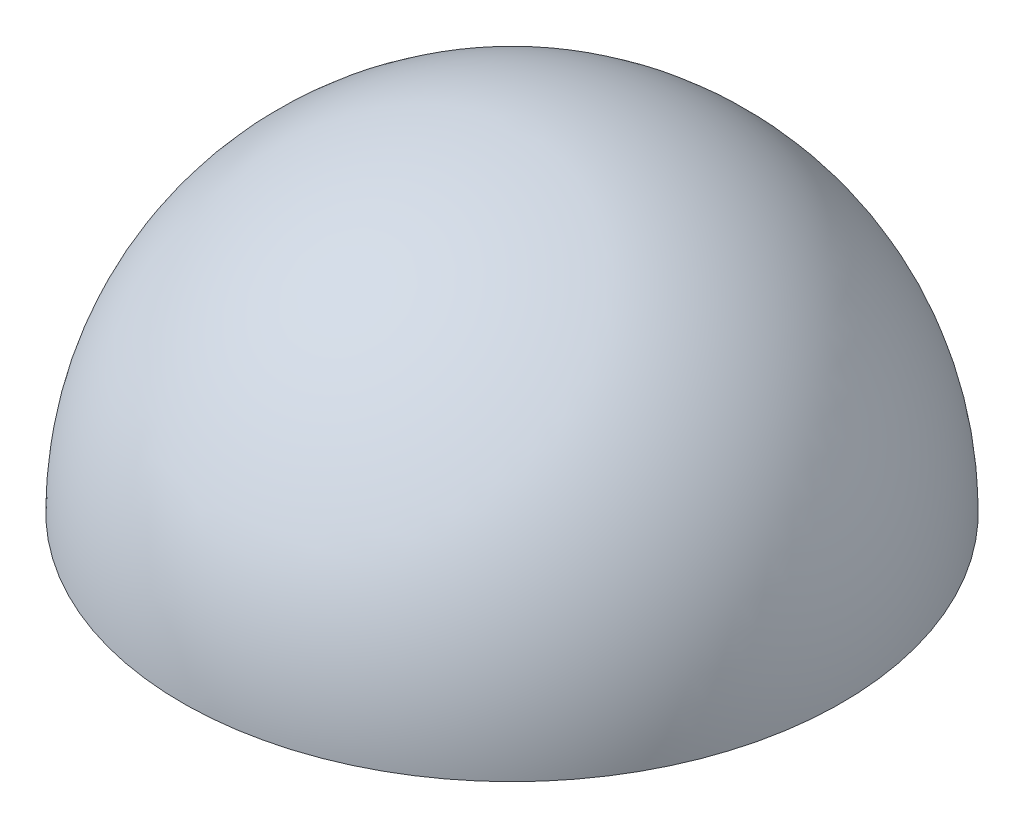
ISO-10303-21;
HEADER;
FILE_DESCRIPTION(('STEP AP214'),'2;1');
FILE_NAME('part.step','',(''),(''),'','','');
FILE_SCHEMA(('AUTOMOTIVE_DESIGN { 1 0 10303 214 1 1 1 1 }'));
ENDSEC;
DATA;
#1=APPLICATION_CONTEXT('core data for automotive mechanical design processes');
#2=APPLICATION_PROTOCOL_DEFINITION('international standard','automotive_design',2000,#1);
#3=PRODUCT_CONTEXT('',#1,'mechanical');
#4=PRODUCT('Part','Part','',(#3));
#5=PRODUCT_RELATED_PRODUCT_CATEGORY('part','',(#4));
#6=PRODUCT_DEFINITION_FORMATION('','',#4);
#7=PRODUCT_DEFINITION_CONTEXT('part definition',#1,'design');
#8=PRODUCT_DEFINITION('design','',#6,#7);
#9=PRODUCT_DEFINITION_SHAPE('','',#8);
#10=(LENGTH_UNIT() NAMED_UNIT(*) SI_UNIT(.MILLI.,.METRE.));
#11=(NAMED_UNIT(*) PLANE_ANGLE_UNIT() SI_UNIT($,.RADIAN.));
#12=(NAMED_UNIT(*) SI_UNIT($,.STERADIAN.) SOLID_ANGLE_UNIT());
#13=UNCERTAINTY_MEASURE_WITH_UNIT(LENGTH_MEASURE(1.E-05),#10,'distance_accuracy_value','');
#14=(GEOMETRIC_REPRESENTATION_CONTEXT(3) GLOBAL_UNCERTAINTY_ASSIGNED_CONTEXT((#13)) GLOBAL_UNIT_ASSIGNED_CONTEXT((#10,
#11,#12)) REPRESENTATION_CONTEXT('',''));
#15=CARTESIAN_POINT('',(0.,0.,0.));
#16=DIRECTION('',(0.,0.,1.));
#17=DIRECTION('',(1.,0.,0.));
#18=AXIS2_PLACEMENT_3D('',#15,#16,#17);
#19=CARTESIAN_POINT('',(0.,-8.,0.));
#20=DIRECTION('',(0.,-1.,0.));
#21=DIRECTION('',(1.,0.,0.));
#22=AXIS2_PLACEMENT_3D('',#19,#20,#21);
#23=CYLINDRICAL_SURFACE('',#22,39.);
#24=CARTESIAN_POINT('',(0.,-8.,0.));
#25=DIRECTION('',(0.,-1.,0.));
#26=DIRECTION('',(1.,0.,0.));
#27=AXIS2_PLACEMENT_3D('',#24,#25,#26);
#28=CIRCLE('',#27,39.);
#29=CARTESIAN_POINT('',(-10.0939427589983,-7.99999999999973,37.6711072252737));
#30=VERTEX_POINT('',#29);
#31=CARTESIAN_POINT('',(-27.5771644662754,-8.00000000000018,27.5771644662752));
#32=VERTEX_POINT('',#31);
#33=EDGE_CURVE('E162',#30,#32,#28,.T.);
#34=ORIENTED_EDGE('',*,*,#33,.T.);
#35=DIRECTION('',(0.,-1.,0.));
#36=VECTOR('',#35,1.);
#37=CARTESIAN_POINT('',(-27.5771644662755,-2.00000000000019,27.5771644662752));
#38=LINE('',#37,#36);
#39=CARTESIAN_POINT('',(-27.5771644662754,-12.0000000000002,27.5771644662752));
#40=VERTEX_POINT('',#39);
#41=EDGE_CURVE('E322',#32,#40,#38,.T.);
#42=ORIENTED_EDGE('',*,*,#41,.T.);
#43=CARTESIAN_POINT('',(0.,-12.,0.));
#44=DIRECTION('',(0.,-1.,0.));
#45=DIRECTION('',(1.,0.,0.));
#46=AXIS2_PLACEMENT_3D('',#43,#44,#45);
#47=CIRCLE('',#46,39.);
#48=CARTESIAN_POINT('',(-10.0939427589982,-12.0000000000001,37.6711072252737));
#49=VERTEX_POINT('',#48);
#50=EDGE_CURVE('E149',#49,#40,#47,.T.);
#51=ORIENTED_EDGE('',*,*,#50,.F.);
#52=DIRECTION('',(0.,-1.,0.));
#53=VECTOR('',#52,1.);
#54=CARTESIAN_POINT('',(-10.0939427589983,-2.00000000000006,37.6711072252737));
#55=LINE('',#54,#53);
#56=EDGE_CURVE('E241',#30,#49,#55,.T.);
#57=ORIENTED_EDGE('',*,*,#56,.F.);
#58=EDGE_LOOP('',(#34,#42,#51,#57));
#59=FACE_BOUND('',#58,.T.);
#60=ADVANCED_FACE('F33',(#59),#23,.T.);
#61=DIRECTION('',(0.,-1.,0.));
#62=VECTOR('',#61,1.);
#63=CARTESIAN_POINT('',(37.6711072252738,-1.99999999999974,-10.093942758998));
#64=LINE('',#63,#62);
#65=CARTESIAN_POINT('',(37.6711072252738,-7.99999999999973,-10.093942758998));
#66=VERTEX_POINT('',#65);
#67=CARTESIAN_POINT('',(37.6711072252738,-11.9999999999997,-10.093942758998));
#68=VERTEX_POINT('',#67);
#69=EDGE_CURVE('E142',#66,#68,#64,.T.);
#70=ORIENTED_EDGE('',*,*,#69,.F.);
#71=CARTESIAN_POINT('',(37.6711072252738,-7.99999999999975,10.0939427589981));
#72=VERTEX_POINT('',#71);
#73=EDGE_CURVE('E153',#66,#72,#28,.T.);
#74=ORIENTED_EDGE('',*,*,#73,.T.);
#75=DIRECTION('',(0.,-1.,0.));
#76=VECTOR('',#75,1.);
#77=CARTESIAN_POINT('',(37.6711072252737,-1.99999999999973,10.0939427589981));
#78=LINE('',#77,#76);
#79=CARTESIAN_POINT('',(37.6711072252738,-11.9999999999997,10.0939427589981));
#80=VERTEX_POINT('',#79);
#81=EDGE_CURVE('E226',#72,#80,#78,.T.);
#82=ORIENTED_EDGE('',*,*,#81,.T.);
#83=EDGE_CURVE('E150',#68,#80,#47,.T.);
#84=ORIENTED_EDGE('',*,*,#83,.F.);
#85=EDGE_LOOP('',(#70,#74,#82,#84));
#86=FACE_BOUND('',#85,.T.);
#87=ADVANCED_FACE('F181',(#86),#23,.T.);
#88=CARTESIAN_POINT('',(0.,7.,0.));
#89=DIRECTION('',(0.,-1.,0.));
#90=DIRECTION('',(1.,0.,0.));
#91=AXIS2_PLACEMENT_3D('',#88,#89,#90);
#92=PLANE('',#91);
#93=CARTESIAN_POINT('',(0.,7.,0.));
#94=DIRECTION('',(0.,-1.,0.));
#95=DIRECTION('',(1.,0.,0.));
#96=AXIS2_PLACEMENT_3D('',#93,#94,#95);
#97=CIRCLE('',#96,30.);
#98=CARTESIAN_POINT('',(30.,7.00000000000021,0.));
#99=VERTEX_POINT('',#98);
#100=EDGE_CURVE('E37',#99,#99,#97,.T.);
#101=ORIENTED_EDGE('',*,*,#100,.T.);
#102=EDGE_LOOP('',(#101));
#103=FACE_BOUND('',#102,.T.);
#104=CARTESIAN_POINT('',(0.,7.,0.));
#105=DIRECTION('',(0.,-1.,0.));
#106=DIRECTION('',(1.,0.,0.));
#107=AXIS2_PLACEMENT_3D('',#104,#105,#106);
#108=CIRCLE('',#107,49.5075751779463);
#109=CARTESIAN_POINT('',(49.5075751779462,7.00000000000035,0.));
#110=VERTEX_POINT('',#109);
#111=EDGE_CURVE('E42',#110,#110,#108,.F.);
#112=ORIENTED_EDGE('',*,*,#111,.T.);
#113=EDGE_LOOP('',(#112));
#114=FACE_BOUND('',#113,.T.);
#115=ADVANCED_FACE('F168',(#103,#114),#92,.F.);
#116=CARTESIAN_POINT('',(0.,0.,0.));
#117=DIRECTION('',(0.999613841431887,0.,0.0277879113606428));
#118=DIRECTION('',(0.0277879113606428,0.,-0.999613841431887));
#119=AXIS2_PLACEMENT_3D('',#116,#117,#118);
#120=SPHERICAL_SURFACE('',#119,50.);
#121=CARTESIAN_POINT('',(0.,0.,0.));
#122=DIRECTION('',(0.,-1.,0.));
#123=DIRECTION('',(1.,0.,0.));
#124=AXIS2_PLACEMENT_3D('',#121,#122,#123);
#125=SPHERICAL_SURFACE('',#124,50.);
#126=ORIENTED_EDGE('',*,*,#111,.F.);
#127=EDGE_LOOP('',(#126));
#128=FACE_BOUND('',#127,.T.);
#129=ADVANCED_FACE('F170',(#128),#125,.F.);
#130=CARTESIAN_POINT('',(0.,12.,0.));
#131=DIRECTION('',(0.,-1.,0.));
#132=DIRECTION('',(1.,0.,0.));
#133=AXIS2_PLACEMENT_3D('',#130,#131,#132);
#134=CYLINDRICAL_SURFACE('',#133,30.);
#135=CARTESIAN_POINT('',(0.,-12.,0.));
#136=DIRECTION('',(0.,-1.,0.));
#137=DIRECTION('',(1.,0.,0.));
#138=AXIS2_PLACEMENT_3D('',#135,#136,#137);
#139=CIRCLE('',#138,30.);
#140=CARTESIAN_POINT('',(30.0000000000001,-11.9999999999998,0.));
#141=VERTEX_POINT('',#140);
#142=EDGE_CURVE('E256',#141,#141,#139,.T.);
#143=ORIENTED_EDGE('',*,*,#142,.T.);
#144=EDGE_LOOP('',(#143));
#145=FACE_BOUND('',#144,.T.);
#146=ORIENTED_EDGE('',*,*,#100,.F.);
#147=EDGE_LOOP('',(#146));
#148=FACE_BOUND('',#147,.T.);
#149=ADVANCED_FACE('F172',(#145,#148),#134,.F.);
#150=CARTESIAN_POINT('',(0.,-12.,0.));
#151=DIRECTION('',(0.,1.,0.));
#152=DIRECTION('',(-1.,0.,0.));
#153=AXIS2_PLACEMENT_3D('',#150,#151,#152);
#154=CYLINDRICAL_SURFACE('',#153,34.5);
#155=CARTESIAN_POINT('',(0.,0.,0.));
#156=DIRECTION('',(0.,-1.,0.));
#157=DIRECTION('',(1.,0.,0.));
#158=AXIS2_PLACEMENT_3D('',#155,#156,#157);
#159=CIRCLE('',#158,34.5);
#160=CARTESIAN_POINT('',(34.5,2.40823587287632E-13,0.));
#161=VERTEX_POINT('',#160);
#162=EDGE_CURVE('E158',#161,#161,#159,.T.);
#163=ORIENTED_EDGE('',*,*,#162,.T.);
#164=EDGE_LOOP('',(#163));
#165=FACE_BOUND('',#164,.T.);
#166=CARTESIAN_POINT('',(0.,-8.,0.));
#167=DIRECTION('',(0.,-1.,0.));
#168=DIRECTION('',(1.,0.,0.));
#169=AXIS2_PLACEMENT_3D('',#166,#167,#168);
#170=CIRCLE('',#169,34.5);
#171=CARTESIAN_POINT('',(34.5,-7.99999999999976,0.));
#172=VERTEX_POINT('',#171);
#173=EDGE_CURVE('E11',#172,#172,#170,.T.);
#174=ORIENTED_EDGE('',*,*,#173,.F.);
#175=EDGE_LOOP('',(#174));
#176=FACE_BOUND('',#175,.T.);
#177=ADVANCED_FACE('F178',(#165,#176),#154,.T.);
#178=CARTESIAN_POINT('',(0.,0.,0.));
#179=DIRECTION('',(0.0271221426448348,0.,-0.999632127023913));
#180=DIRECTION('',(-0.999632127023913,0.,-0.0271221426448348));
#181=AXIS2_PLACEMENT_3D('',#178,#179,#180);
#182=SPHERICAL_SURFACE('',#181,55.);
#183=CARTESIAN_POINT('',(0.,0.,0.));
#184=DIRECTION('',(0.,-1.,0.));
#185=DIRECTION('',(-0.0542243302830044,0.,0.998528778756707));
#186=AXIS2_PLACEMENT_3D('',#183,#184,#185);
#187=SPHERICAL_SURFACE('',#186,55.);
#188=CARTESIAN_POINT('',(0.,0.,0.));
#189=DIRECTION('',(0.,-1.,0.));
#190=DIRECTION('',(-0.0542243302830044,0.,0.998528778756707));
#191=AXIS2_PLACEMENT_3D('',#188,#189,#190);
#192=CIRCLE('',#191,55.);
#193=CARTESIAN_POINT('',(-2.98233816556524,0.,54.9190828316189));
#194=VERTEX_POINT('',#193);
#195=EDGE_CURVE('E161',#194,#194,#192,.T.);
#196=ORIENTED_EDGE('',*,*,#195,.F.);
#197=EDGE_LOOP('',(#196));
#198=FACE_BOUND('',#197,.T.);
#199=ADVANCED_FACE('F35',(#198),#187,.T.);
#200=CARTESIAN_POINT('',(0.,0.,0.));
#201=DIRECTION('',(0.,-1.,0.));
#202=DIRECTION('',(-0.0542243302830044,0.,0.998528778756707));
#203=AXIS2_PLACEMENT_3D('',#200,#201,#202);
#204=PLANE('',#203);
#205=ORIENTED_EDGE('',*,*,#162,.F.);
#206=EDGE_LOOP('',(#205));
#207=FACE_BOUND('',#206,.T.);
#208=ORIENTED_EDGE('',*,*,#195,.T.);
#209=EDGE_LOOP('',(#208));
#210=FACE_BOUND('',#209,.T.);
#211=ADVANCED_FACE('F196',(#207,#210),#204,.T.);
#212=DIRECTION('',(0.,-1.,0.));
#213=VECTOR('',#212,1.);
#214=CARTESIAN_POINT('',(-27.5771644662754,-2.0000000000002,-27.5771644662753));
#215=LINE('',#214,#213);
#216=CARTESIAN_POINT('',(-27.5771644662753,-7.99999999999973,-27.5771644662753));
#217=VERTEX_POINT('',#216);
#218=CARTESIAN_POINT('',(-27.5771644662753,-12.0000000000002,-27.5771644662753));
#219=VERTEX_POINT('',#218);
#220=EDGE_CURVE('E320',#217,#219,#215,.T.);
#221=ORIENTED_EDGE('',*,*,#220,.F.);
#222=CARTESIAN_POINT('',(-10.0939427589985,-8.00000000000007,-37.6711072252736));
#223=VERTEX_POINT('',#222);
#224=EDGE_CURVE('E141',#217,#223,#28,.T.);
#225=ORIENTED_EDGE('',*,*,#224,.T.);
#226=DIRECTION('',(0.,-1.,0.));
#227=VECTOR('',#226,1.);
#228=CARTESIAN_POINT('',(-10.0939427589985,-2.00000000000008,-37.6711072252736));
#229=LINE('',#228,#227);
#230=CARTESIAN_POINT('',(-10.0939427589985,-12.0000000000001,-37.6711072252736));
#231=VERTEX_POINT('',#230);
#232=EDGE_CURVE('E127',#223,#231,#229,.T.);
#233=ORIENTED_EDGE('',*,*,#232,.T.);
#234=EDGE_CURVE('E139',#219,#231,#47,.T.);
#235=ORIENTED_EDGE('',*,*,#234,.F.);
#236=EDGE_LOOP('',(#221,#225,#233,#235));
#237=FACE_BOUND('',#236,.T.);
#238=ADVANCED_FACE('F138',(#237),#23,.T.);
#239=CARTESIAN_POINT('',(0.,-8.,0.));
#240=DIRECTION('',(0.,-1.,0.));
#241=DIRECTION('',(1.,0.,0.));
#242=AXIS2_PLACEMENT_3D('',#239,#240,#241);
#243=PLANE('',#242);
#244=ORIENTED_EDGE('',*,*,#173,.T.);
#245=EDGE_LOOP('',(#244));
#246=FACE_BOUND('',#245,.T.);
#247=ORIENTED_EDGE('',*,*,#224,.F.);
#248=DIRECTION('',(0.707106781186548,0.,0.707106781186547));
#249=VECTOR('',#248,1.);
#250=CARTESIAN_POINT('',(0.,-8.,0.));
#251=LINE('',#250,#249);
#252=CARTESIAN_POINT('',(-24.7487373415291,-8.00000000000019,-24.7487373415292));
#253=VERTEX_POINT('',#252);
#254=EDGE_CURVE('E218',#217,#253,#251,.T.);
#255=ORIENTED_EDGE('',*,*,#254,.T.);
#256=CARTESIAN_POINT('',(0.,-8.,0.));
#257=DIRECTION('',(0.,-1.,0.));
#258=DIRECTION('',(1.,0.,0.));
#259=AXIS2_PLACEMENT_3D('',#256,#257,#258);
#260=CIRCLE('',#259,35.);
#261=CARTESIAN_POINT('',(-24.7487373415292,-8.00000000000018,24.7487373415291));
#262=VERTEX_POINT('',#261);
#263=EDGE_CURVE('E255',#262,#253,#260,.T.);
#264=ORIENTED_EDGE('',*,*,#263,.F.);
#265=DIRECTION('',(0.707106781186551,0.,-0.707106781186544));
#266=VECTOR('',#265,1.);
#267=CARTESIAN_POINT('',(0.,-8.,0.));
#268=LINE('',#267,#266);
#269=EDGE_CURVE('E252',#32,#262,#268,.T.);
#270=ORIENTED_EDGE('',*,*,#269,.F.);
#271=ORIENTED_EDGE('',*,*,#33,.F.);
#272=DIRECTION('',(0.258819045102521,0.,-0.965925826289068));
#273=VECTOR('',#272,1.);
#274=CARTESIAN_POINT('',(0.,-8.,0.));
#275=LINE('',#274,#273);
#276=CARTESIAN_POINT('',(-9.05866657858818,-8.00000000000006,33.8074039201174));
#277=VERTEX_POINT('',#276);
#278=EDGE_CURVE('E237',#30,#277,#275,.T.);
#279=ORIENTED_EDGE('',*,*,#278,.T.);
#280=CARTESIAN_POINT('',(0.,-8.,0.));
#281=DIRECTION('',(0.,-1.,0.));
#282=DIRECTION('',(1.,0.,0.));
#283=AXIS2_PLACEMENT_3D('',#280,#281,#282);
#284=CIRCLE('',#283,35.);
#285=CARTESIAN_POINT('',(33.8074039201175,-7.99999999999975,9.05866657858805));
#286=VERTEX_POINT('',#285);
#287=EDGE_CURVE('E233',#286,#277,#284,.T.);
#288=ORIENTED_EDGE('',*,*,#287,.F.);
#289=DIRECTION('',(-0.96592582628907,0.,-0.258819045102516));
#290=VECTOR('',#289,1.);
#291=CARTESIAN_POINT('',(0.,-8.,0.));
#292=LINE('',#291,#290);
#293=EDGE_CURVE('E231',#72,#286,#292,.T.);
#294=ORIENTED_EDGE('',*,*,#293,.F.);
#295=ORIENTED_EDGE('',*,*,#73,.F.);
#296=DIRECTION('',(-0.96592582628907,0.,0.258819045102514));
#297=VECTOR('',#296,1.);
#298=CARTESIAN_POINT('',(0.,-8.,0.));
#299=LINE('',#298,#297);
#300=CARTESIAN_POINT('',(33.8074039201175,-7.99999999999975,-9.05866657858798));
#301=VERTEX_POINT('',#300);
#302=EDGE_CURVE('E229',#66,#301,#299,.T.);
#303=ORIENTED_EDGE('',*,*,#302,.T.);
#304=CARTESIAN_POINT('',(0.,-8.,0.));
#305=DIRECTION('',(0.,-1.,0.));
#306=DIRECTION('',(1.,0.,0.));
#307=AXIS2_PLACEMENT_3D('',#304,#305,#306);
#308=CIRCLE('',#307,35.);
#309=CARTESIAN_POINT('',(-9.05866657858837,-8.00000000000007,-33.8074039201173));
#310=VERTEX_POINT('',#309);
#311=EDGE_CURVE('E250',#310,#301,#308,.T.);
#312=ORIENTED_EDGE('',*,*,#311,.F.);
#313=DIRECTION('',(-0.258819045102527,0.,-0.965925826289067));
#314=VECTOR('',#313,1.);
#315=CARTESIAN_POINT('',(0.,-8.,0.));
#316=LINE('',#315,#314);
#317=EDGE_CURVE('E220',#310,#223,#316,.T.);
#318=ORIENTED_EDGE('',*,*,#317,.T.);
#319=EDGE_LOOP('',(#247,#255,#264,#270,#271,#279,#288,#294,#295,#303,#312,#318));
#320=FACE_BOUND('',#319,.T.);
#321=ADVANCED_FACE('F195',(#246,#320),#243,.F.);
#322=CARTESIAN_POINT('',(0.,-12.,0.));
#323=DIRECTION('',(0.,-1.,0.));
#324=DIRECTION('',(1.,0.,0.));
#325=AXIS2_PLACEMENT_3D('',#322,#323,#324);
#326=PLANE('',#325);
#327=DIRECTION('',(0.707106781186548,0.,0.707106781186547));
#328=VECTOR('',#327,1.);
#329=CARTESIAN_POINT('',(0.,-12.,0.));
#330=LINE('',#329,#328);
#331=CARTESIAN_POINT('',(-24.7487373415291,-12.0000000000002,-24.7487373415291));
#332=VERTEX_POINT('',#331);
#333=EDGE_CURVE('E148',#219,#332,#330,.T.);
#334=ORIENTED_EDGE('',*,*,#333,.F.);
#335=ORIENTED_EDGE('',*,*,#234,.T.);
#336=DIRECTION('',(-0.258819045102527,0.,-0.965925826289067));
#337=VECTOR('',#336,1.);
#338=CARTESIAN_POINT('',(0.,-12.,0.));
#339=LINE('',#338,#337);
#340=CARTESIAN_POINT('',(-9.05866657858834,-12.0000000000001,-33.8074039201173));
#341=VERTEX_POINT('',#340);
#342=EDGE_CURVE('E124',#341,#231,#339,.T.);
#343=ORIENTED_EDGE('',*,*,#342,.F.);
#344=CARTESIAN_POINT('',(0.,-12.,0.));
#345=DIRECTION('',(0.,-1.,0.));
#346=DIRECTION('',(1.,0.,0.));
#347=AXIS2_PLACEMENT_3D('',#344,#345,#346);
#348=CIRCLE('',#347,35.);
#349=CARTESIAN_POINT('',(33.8074039201175,-11.9999999999998,-9.05866657858798));
#350=VERTEX_POINT('',#349);
#351=EDGE_CURVE('E57',#341,#350,#348,.T.);
#352=ORIENTED_EDGE('',*,*,#351,.T.);
#353=DIRECTION('',(-0.96592582628907,0.,0.258819045102514));
#354=VECTOR('',#353,1.);
#355=CARTESIAN_POINT('',(0.,-12.,0.));
#356=LINE('',#355,#354);
#357=EDGE_CURVE('E132',#68,#350,#356,.T.);
#358=ORIENTED_EDGE('',*,*,#357,.F.);
#359=ORIENTED_EDGE('',*,*,#83,.T.);
#360=DIRECTION('',(-0.96592582628907,0.,-0.258819045102516));
#361=VECTOR('',#360,1.);
#362=CARTESIAN_POINT('',(0.,-12.,0.));
#363=LINE('',#362,#361);
#364=CARTESIAN_POINT('',(33.8074039201175,-11.9999999999998,9.05866657858803));
#365=VERTEX_POINT('',#364);
#366=EDGE_CURVE('E328',#80,#365,#363,.T.);
#367=ORIENTED_EDGE('',*,*,#366,.T.);
#368=CARTESIAN_POINT('',(0.,-12.,0.));
#369=DIRECTION('',(0.,-1.,0.));
#370=DIRECTION('',(1.,0.,0.));
#371=AXIS2_PLACEMENT_3D('',#368,#369,#370);
#372=CIRCLE('',#371,35.);
#373=CARTESIAN_POINT('',(-9.05866657858816,-12.0000000000001,33.8074039201174));
#374=VERTEX_POINT('',#373);
#375=EDGE_CURVE('E310',#365,#374,#372,.T.);
#376=ORIENTED_EDGE('',*,*,#375,.T.);
#377=DIRECTION('',(0.258819045102521,0.,-0.965925826289068));
#378=VECTOR('',#377,1.);
#379=CARTESIAN_POINT('',(0.,-12.,0.));
#380=LINE('',#379,#378);
#381=EDGE_CURVE('E330',#49,#374,#380,.T.);
#382=ORIENTED_EDGE('',*,*,#381,.F.);
#383=ORIENTED_EDGE('',*,*,#50,.T.);
#384=DIRECTION('',(0.707106781186551,0.,-0.707106781186544));
#385=VECTOR('',#384,1.);
#386=CARTESIAN_POINT('',(0.,-12.,0.));
#387=LINE('',#386,#385);
#388=CARTESIAN_POINT('',(-24.7487373415292,-12.0000000000002,24.7487373415291));
#389=VERTEX_POINT('',#388);
#390=EDGE_CURVE('E313',#40,#389,#387,.T.);
#391=ORIENTED_EDGE('',*,*,#390,.T.);
#392=CARTESIAN_POINT('',(0.,-12.,0.));
#393=DIRECTION('',(0.,-1.,0.));
#394=DIRECTION('',(1.,0.,0.));
#395=AXIS2_PLACEMENT_3D('',#392,#393,#394);
#396=CIRCLE('',#395,35.);
#397=EDGE_CURVE('E49',#389,#332,#396,.T.);
#398=ORIENTED_EDGE('',*,*,#397,.T.);
#399=EDGE_LOOP('',(#334,#335,#343,#352,#358,#359,#367,#376,#382,#383,#391,#398));
#400=FACE_BOUND('',#399,.T.);
#401=ORIENTED_EDGE('',*,*,#142,.F.);
#402=EDGE_LOOP('',(#401));
#403=FACE_BOUND('',#402,.T.);
#404=ADVANCED_FACE('F145',(#400,#403),#326,.T.);
#405=CARTESIAN_POINT('',(0.,-2.,0.));
#406=DIRECTION('',(0.,-1.,0.));
#407=DIRECTION('',(1.,0.,0.));
#408=AXIS2_PLACEMENT_3D('',#405,#406,#407);
#409=CYLINDRICAL_SURFACE('',#408,35.);
#410=ORIENTED_EDGE('',*,*,#287,.T.);
#411=DIRECTION('',(0.,-1.,0.));
#412=VECTOR('',#411,1.);
#413=CARTESIAN_POINT('',(-9.05866657858823,-2.00000000000006,33.8074039201174));
#414=LINE('',#413,#412);
#415=EDGE_CURVE('E238',#277,#374,#414,.T.);
#416=ORIENTED_EDGE('',*,*,#415,.T.);
#417=ORIENTED_EDGE('',*,*,#375,.F.);
#418=DIRECTION('',(0.,-1.,0.));
#419=VECTOR('',#418,1.);
#420=CARTESIAN_POINT('',(33.8074039201175,-1.99999999999976,9.05866657858804));
#421=LINE('',#420,#419);
#422=EDGE_CURVE('E244',#286,#365,#421,.T.);
#423=ORIENTED_EDGE('',*,*,#422,.F.);
#424=EDGE_LOOP('',(#410,#416,#417,#423));
#425=FACE_BOUND('',#424,.T.);
#426=ADVANCED_FACE('F263',(#425),#409,.T.);
#427=CARTESIAN_POINT('',(0.,-2.,0.));
#428=DIRECTION('',(-0.965925826289068,0.,-0.258819045102521));
#429=DIRECTION('',(-0.258819045102521,0.,0.965925826289068));
#430=AXIS2_PLACEMENT_3D('',#427,#428,#429);
#431=PLANE('',#430);
#432=ORIENTED_EDGE('',*,*,#56,.T.);
#433=ORIENTED_EDGE('',*,*,#381,.T.);
#434=ORIENTED_EDGE('',*,*,#415,.F.);
#435=ORIENTED_EDGE('',*,*,#278,.F.);
#436=EDGE_LOOP('',(#432,#433,#434,#435));
#437=FACE_BOUND('',#436,.T.);
#438=ADVANCED_FACE('F267',(#437),#431,.F.);
#439=CARTESIAN_POINT('',(0.,-2.,0.));
#440=DIRECTION('',(-0.258819045102516,0.,0.96592582628907));
#441=DIRECTION('',(0.96592582628907,0.,0.258819045102516));
#442=AXIS2_PLACEMENT_3D('',#439,#440,#441);
#443=PLANE('',#442);
#444=ORIENTED_EDGE('',*,*,#293,.T.);
#445=ORIENTED_EDGE('',*,*,#422,.T.);
#446=ORIENTED_EDGE('',*,*,#366,.F.);
#447=ORIENTED_EDGE('',*,*,#81,.F.);
#448=EDGE_LOOP('',(#444,#445,#446,#447));
#449=FACE_BOUND('',#448,.T.);
#450=ADVANCED_FACE('F273',(#449),#443,.T.);
#451=CARTESIAN_POINT('',(0.,-2.,0.));
#452=DIRECTION('',(0.,-1.,0.));
#453=DIRECTION('',(1.,0.,0.));
#454=AXIS2_PLACEMENT_3D('',#451,#452,#453);
#455=CYLINDRICAL_SURFACE('',#454,35.);
#456=ORIENTED_EDGE('',*,*,#311,.T.);
#457=DIRECTION('',(0.,-1.,0.));
#458=VECTOR('',#457,1.);
#459=CARTESIAN_POINT('',(33.8074039201175,-1.99999999999977,-9.05866657858798));
#460=LINE('',#459,#458);
#461=EDGE_CURVE('E303',#301,#350,#460,.T.);
#462=ORIENTED_EDGE('',*,*,#461,.T.);
#463=ORIENTED_EDGE('',*,*,#351,.F.);
#464=DIRECTION('',(0.,-1.,0.));
#465=VECTOR('',#464,1.);
#466=CARTESIAN_POINT('',(-9.05866657858841,-2.00000000000007,-33.8074039201173));
#467=LINE('',#466,#465);
#468=EDGE_CURVE('E129',#310,#341,#467,.T.);
#469=ORIENTED_EDGE('',*,*,#468,.F.);
#470=EDGE_LOOP('',(#456,#462,#463,#469));
#471=FACE_BOUND('',#470,.T.);
#472=ADVANCED_FACE('F278',(#471),#455,.T.);
#473=CARTESIAN_POINT('',(0.,-2.,0.));
#474=DIRECTION('',(0.258819045102514,0.,0.96592582628907));
#475=DIRECTION('',(0.96592582628907,0.,-0.258819045102514));
#476=AXIS2_PLACEMENT_3D('',#473,#474,#475);
#477=PLANE('',#476);
#478=ORIENTED_EDGE('',*,*,#69,.T.);
#479=ORIENTED_EDGE('',*,*,#357,.T.);
#480=ORIENTED_EDGE('',*,*,#461,.F.);
#481=ORIENTED_EDGE('',*,*,#302,.F.);
#482=EDGE_LOOP('',(#478,#479,#480,#481));
#483=FACE_BOUND('',#482,.T.);
#484=ADVANCED_FACE('F293',(#483),#477,.F.);
#485=CARTESIAN_POINT('',(0.,-2.,0.));
#486=DIRECTION('',(-0.965925826289067,0.,0.258819045102526));
#487=DIRECTION('',(0.258819045102527,0.,0.965925826289067));
#488=AXIS2_PLACEMENT_3D('',#485,#486,#487);
#489=PLANE('',#488);
#490=ORIENTED_EDGE('',*,*,#468,.T.);
#491=ORIENTED_EDGE('',*,*,#342,.T.);
#492=ORIENTED_EDGE('',*,*,#232,.F.);
#493=ORIENTED_EDGE('',*,*,#317,.F.);
#494=EDGE_LOOP('',(#490,#491,#492,#493));
#495=FACE_BOUND('',#494,.T.);
#496=ADVANCED_FACE('F126',(#495),#489,.F.);
#497=CARTESIAN_POINT('',(0.,-2.,0.));
#498=DIRECTION('',(0.,-1.,0.));
#499=DIRECTION('',(1.,0.,0.));
#500=AXIS2_PLACEMENT_3D('',#497,#498,#499);
#501=CYLINDRICAL_SURFACE('',#500,35.);
#502=ORIENTED_EDGE('',*,*,#263,.T.);
#503=DIRECTION('',(0.,-1.,0.));
#504=VECTOR('',#503,1.);
#505=CARTESIAN_POINT('',(-24.7487373415292,-2.00000000000018,-24.7487373415292));
#506=LINE('',#505,#504);
#507=EDGE_CURVE('E318',#253,#332,#506,.T.);
#508=ORIENTED_EDGE('',*,*,#507,.T.);
#509=ORIENTED_EDGE('',*,*,#397,.F.);
#510=DIRECTION('',(0.,-1.,0.));
#511=VECTOR('',#510,1.);
#512=CARTESIAN_POINT('',(-24.7487373415293,-2.00000000000017,24.7487373415291));
#513=LINE('',#512,#511);
#514=EDGE_CURVE('E317',#262,#389,#513,.T.);
#515=ORIENTED_EDGE('',*,*,#514,.F.);
#516=EDGE_LOOP('',(#502,#508,#509,#515));
#517=FACE_BOUND('',#516,.T.);
#518=ADVANCED_FACE('F280',(#517),#501,.T.);
#519=CARTESIAN_POINT('',(0.,-2.,0.));
#520=DIRECTION('',(0.707106781186547,0.,-0.707106781186548));
#521=DIRECTION('',(-0.707106781186548,0.,-0.707106781186547));
#522=AXIS2_PLACEMENT_3D('',#519,#520,#521);
#523=PLANE('',#522);
#524=ORIENTED_EDGE('',*,*,#220,.T.);
#525=ORIENTED_EDGE('',*,*,#333,.T.);
#526=ORIENTED_EDGE('',*,*,#507,.F.);
#527=ORIENTED_EDGE('',*,*,#254,.F.);
#528=EDGE_LOOP('',(#524,#525,#526,#527));
#529=FACE_BOUND('',#528,.T.);
#530=ADVANCED_FACE('F283',(#529),#523,.F.);
#531=CARTESIAN_POINT('',(0.,-2.,0.));
#532=DIRECTION('',(-0.707106781186544,0.,-0.707106781186551));
#533=DIRECTION('',(-0.707106781186551,0.,0.707106781186544));
#534=AXIS2_PLACEMENT_3D('',#531,#532,#533);
#535=PLANE('',#534);
#536=ORIENTED_EDGE('',*,*,#269,.T.);
#537=ORIENTED_EDGE('',*,*,#514,.T.);
#538=ORIENTED_EDGE('',*,*,#390,.F.);
#539=ORIENTED_EDGE('',*,*,#41,.F.);
#540=EDGE_LOOP('',(#536,#537,#538,#539));
#541=FACE_BOUND('',#540,.T.);
#542=ADVANCED_FACE('F284',(#541),#535,.T.);
#543=CLOSED_SHELL('',(#60,#87,#115,#129,#149,#177,#199,#211,#238,#321,#404,#426,#438,#450,#472,
#484,#496,#518,#530,#542));
#544=MANIFOLD_SOLID_BREP('B2',#543);
#545=ADVANCED_BREP_SHAPE_REPRESENTATION('',(#18,#544),#14);
#546=SHAPE_DEFINITION_REPRESENTATION(#9,#545);
ENDSEC;
END-ISO-10303-21;
